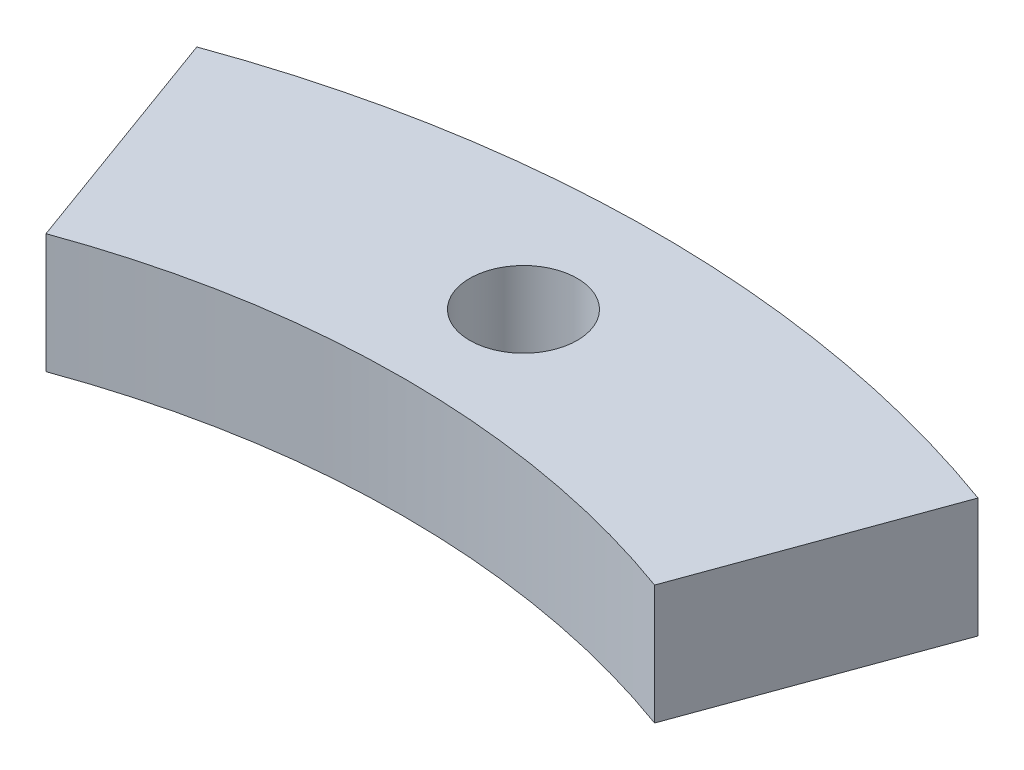
ISO-10303-21;
HEADER;
FILE_DESCRIPTION(('STEP AP214'),'2;1');
FILE_NAME('part.step','',(''),(''),'','','');
FILE_SCHEMA(('AUTOMOTIVE_DESIGN { 1 0 10303 214 1 1 1 1 }'));
ENDSEC;
DATA;
#1=APPLICATION_CONTEXT('core data for automotive mechanical design processes');
#2=APPLICATION_PROTOCOL_DEFINITION('international standard','automotive_design',2000,#1);
#3=PRODUCT_CONTEXT('',#1,'mechanical');
#4=PRODUCT('Part','Part','',(#3));
#5=PRODUCT_RELATED_PRODUCT_CATEGORY('part','',(#4));
#6=PRODUCT_DEFINITION_FORMATION('','',#4);
#7=PRODUCT_DEFINITION_CONTEXT('part definition',#1,'design');
#8=PRODUCT_DEFINITION('design','',#6,#7);
#9=PRODUCT_DEFINITION_SHAPE('','',#8);
#10=(LENGTH_UNIT() NAMED_UNIT(*) SI_UNIT(.MILLI.,.METRE.));
#11=(NAMED_UNIT(*) PLANE_ANGLE_UNIT() SI_UNIT($,.RADIAN.));
#12=(NAMED_UNIT(*) SI_UNIT($,.STERADIAN.) SOLID_ANGLE_UNIT());
#13=UNCERTAINTY_MEASURE_WITH_UNIT(LENGTH_MEASURE(1.E-05),#10,'distance_accuracy_value','');
#14=(GEOMETRIC_REPRESENTATION_CONTEXT(3) GLOBAL_UNCERTAINTY_ASSIGNED_CONTEXT((#13)) GLOBAL_UNIT_ASSIGNED_CONTEXT((#10,
#11,#12)) REPRESENTATION_CONTEXT('',''));
#15=CARTESIAN_POINT('',(0.,0.,0.));
#16=DIRECTION('',(0.,0.,1.));
#17=DIRECTION('',(1.,0.,0.));
#18=AXIS2_PLACEMENT_3D('',#15,#16,#17);
#19=CARTESIAN_POINT('',(0.,4.5,0.));
#20=DIRECTION('',(0.,1.,0.));
#21=DIRECTION('',(0.,0.,1.));
#22=AXIS2_PLACEMENT_3D('',#19,#20,#21);
#23=PLANE('',#22);
#24=CARTESIAN_POINT('',(0.,4.5,-38.));
#25=DIRECTION('',(0.,1.,0.));
#26=DIRECTION('',(0.,0.,1.));
#27=AXIS2_PLACEMENT_3D('',#24,#25,#26);
#28=CIRCLE('',#27,2.025);
#29=CARTESIAN_POINT('',(0.,4.5,-35.975));
#30=VERTEX_POINT('',#29);
#31=EDGE_CURVE('E91',#30,#30,#28,.T.);
#32=ORIENTED_EDGE('',*,*,#31,.F.);
#33=EDGE_LOOP('',(#32));
#34=FACE_BOUND('',#33,.T.);
#35=CARTESIAN_POINT('',(0.,4.5,0.));
#36=DIRECTION('',(0.,1.,0.));
#37=DIRECTION('',(0.,0.,1.));
#38=AXIS2_PLACEMENT_3D('',#35,#36,#37);
#39=CIRCLE('',#38,43.);
#40=CARTESIAN_POINT('',(14.7068661630035,4.5,-40.4067826937942));
#41=VERTEX_POINT('',#40);
#42=CARTESIAN_POINT('',(-14.7068661630035,4.5,-40.4067826937942));
#43=VERTEX_POINT('',#42);
#44=EDGE_CURVE('E95',#41,#43,#39,.T.);
#45=ORIENTED_EDGE('',*,*,#44,.T.);
#46=DIRECTION('',(0.342020143325663,0.,0.939692620785911));
#47=VECTOR('',#46,1.);
#48=CARTESIAN_POINT('',(0.,4.5,0.));
#49=LINE('',#48,#47);
#50=CARTESIAN_POINT('',(-11.4576748014097,4.5,-31.479702796328));
#51=VERTEX_POINT('',#50);
#52=EDGE_CURVE('E76',#43,#51,#49,.T.);
#53=ORIENTED_EDGE('',*,*,#52,.T.);
#54=CARTESIAN_POINT('',(0.,4.5,0.));
#55=DIRECTION('',(0.,1.,0.));
#56=DIRECTION('',(0.,0.,1.));
#57=AXIS2_PLACEMENT_3D('',#54,#55,#56);
#58=CIRCLE('',#57,33.5);
#59=CARTESIAN_POINT('',(11.4576748014097,4.5,-31.479702796328));
#60=VERTEX_POINT('',#59);
#61=EDGE_CURVE('E96',#60,#51,#58,.T.);
#62=ORIENTED_EDGE('',*,*,#61,.F.);
#63=DIRECTION('',(-0.342020143325663,0.,0.939692620785911));
#64=VECTOR('',#63,1.);
#65=CARTESIAN_POINT('',(0.,4.5,0.));
#66=LINE('',#65,#64);
#67=EDGE_CURVE('E57',#41,#60,#66,.T.);
#68=ORIENTED_EDGE('',*,*,#67,.F.);
#69=EDGE_LOOP('',(#45,#53,#62,#68));
#70=FACE_BOUND('',#69,.T.);
#71=ADVANCED_FACE('F35',(#34,#70),#23,.T.);
#72=CARTESIAN_POINT('',(0.,0.,0.));
#73=DIRECTION('',(0.,1.,0.));
#74=DIRECTION('',(0.,0.,1.));
#75=AXIS2_PLACEMENT_3D('',#72,#73,#74);
#76=PLANE('',#75);
#77=CARTESIAN_POINT('',(0.,0.,-38.));
#78=DIRECTION('',(0.,1.,0.));
#79=DIRECTION('',(0.,0.,1.));
#80=AXIS2_PLACEMENT_3D('',#77,#78,#79);
#81=CIRCLE('',#80,2.025);
#82=CARTESIAN_POINT('',(0.,0.,-35.975));
#83=VERTEX_POINT('',#82);
#84=EDGE_CURVE('E113',#83,#83,#81,.T.);
#85=ORIENTED_EDGE('',*,*,#84,.T.);
#86=EDGE_LOOP('',(#85));
#87=FACE_BOUND('',#86,.T.);
#88=DIRECTION('',(0.342020143325663,0.,0.939692620785911));
#89=VECTOR('',#88,1.);
#90=CARTESIAN_POINT('',(0.,0.,0.));
#91=LINE('',#90,#89);
#92=CARTESIAN_POINT('',(-14.7068661630035,0.,-40.4067826937941));
#93=VERTEX_POINT('',#92);
#94=CARTESIAN_POINT('',(-11.4576748014097,0.,-31.479702796328));
#95=VERTEX_POINT('',#94);
#96=EDGE_CURVE('E50',#93,#95,#91,.T.);
#97=ORIENTED_EDGE('',*,*,#96,.F.);
#98=CARTESIAN_POINT('',(0.,0.,0.));
#99=DIRECTION('',(0.,1.,0.));
#100=DIRECTION('',(0.,0.,1.));
#101=AXIS2_PLACEMENT_3D('',#98,#99,#100);
#102=CIRCLE('',#101,43.);
#103=CARTESIAN_POINT('',(14.7068661630035,0.,-40.4067826937941));
#104=VERTEX_POINT('',#103);
#105=EDGE_CURVE('E88',#104,#93,#102,.T.);
#106=ORIENTED_EDGE('',*,*,#105,.F.);
#107=DIRECTION('',(-0.342020143325663,0.,0.939692620785911));
#108=VECTOR('',#107,1.);
#109=CARTESIAN_POINT('',(0.,0.,0.));
#110=LINE('',#109,#108);
#111=CARTESIAN_POINT('',(11.4576748014097,0.,-31.479702796328));
#112=VERTEX_POINT('',#111);
#113=EDGE_CURVE('E81',#104,#112,#110,.T.);
#114=ORIENTED_EDGE('',*,*,#113,.T.);
#115=CARTESIAN_POINT('',(0.,0.,0.));
#116=DIRECTION('',(0.,1.,0.));
#117=DIRECTION('',(0.,0.,1.));
#118=AXIS2_PLACEMENT_3D('',#115,#116,#117);
#119=CIRCLE('',#118,33.5);
#120=EDGE_CURVE('E90',#112,#95,#119,.T.);
#121=ORIENTED_EDGE('',*,*,#120,.T.);
#122=EDGE_LOOP('',(#97,#106,#114,#121));
#123=FACE_BOUND('',#122,.T.);
#124=ADVANCED_FACE('F86',(#87,#123),#76,.F.);
#125=CARTESIAN_POINT('',(0.,4.5,0.));
#126=DIRECTION('',(0.,-1.,0.));
#127=DIRECTION('',(0.,0.,-1.));
#128=AXIS2_PLACEMENT_3D('',#125,#126,#127);
#129=CYLINDRICAL_SURFACE('',#128,43.);
#130=DIRECTION('',(0.,-1.,0.));
#131=VECTOR('',#130,1.);
#132=CARTESIAN_POINT('',(-14.7068661630035,4.5,-40.4067826937942));
#133=LINE('',#132,#131);
#134=EDGE_CURVE('E73',#43,#93,#133,.T.);
#135=ORIENTED_EDGE('',*,*,#134,.F.);
#136=ORIENTED_EDGE('',*,*,#44,.F.);
#137=DIRECTION('',(0.,-1.,0.));
#138=VECTOR('',#137,1.);
#139=CARTESIAN_POINT('',(14.7068661630035,4.5,-40.4067826937942));
#140=LINE('',#139,#138);
#141=EDGE_CURVE('E94',#41,#104,#140,.T.);
#142=ORIENTED_EDGE('',*,*,#141,.T.);
#143=ORIENTED_EDGE('',*,*,#105,.T.);
#144=EDGE_LOOP('',(#135,#136,#142,#143));
#145=FACE_BOUND('',#144,.T.);
#146=ADVANCED_FACE('F37',(#145),#129,.T.);
#147=CARTESIAN_POINT('',(0.,4.5,0.));
#148=DIRECTION('',(0.,-1.,0.));
#149=DIRECTION('',(0.,0.,-1.));
#150=AXIS2_PLACEMENT_3D('',#147,#148,#149);
#151=CYLINDRICAL_SURFACE('',#150,33.5);
#152=ORIENTED_EDGE('',*,*,#61,.T.);
#153=DIRECTION('',(0.,-1.,0.));
#154=VECTOR('',#153,1.);
#155=CARTESIAN_POINT('',(-11.4576748014097,4.5,-31.479702796328));
#156=LINE('',#155,#154);
#157=EDGE_CURVE('E11',#51,#95,#156,.T.);
#158=ORIENTED_EDGE('',*,*,#157,.T.);
#159=ORIENTED_EDGE('',*,*,#120,.F.);
#160=DIRECTION('',(0.,-1.,0.));
#161=VECTOR('',#160,1.);
#162=CARTESIAN_POINT('',(11.4576748014097,4.5,-31.479702796328));
#163=LINE('',#162,#161);
#164=EDGE_CURVE('E43',#60,#112,#163,.T.);
#165=ORIENTED_EDGE('',*,*,#164,.F.);
#166=EDGE_LOOP('',(#152,#158,#159,#165));
#167=FACE_BOUND('',#166,.T.);
#168=ADVANCED_FACE('F106',(#167),#151,.F.);
#169=CARTESIAN_POINT('',(0.,0.,0.));
#170=DIRECTION('',(-0.939692620785911,0.,-0.342020143325663));
#171=DIRECTION('',(-0.342020143325663,0.,0.939692620785911));
#172=AXIS2_PLACEMENT_3D('',#169,#170,#171);
#173=PLANE('',#172);
#174=ORIENTED_EDGE('',*,*,#67,.T.);
#175=ORIENTED_EDGE('',*,*,#164,.T.);
#176=ORIENTED_EDGE('',*,*,#113,.F.);
#177=ORIENTED_EDGE('',*,*,#141,.F.);
#178=EDGE_LOOP('',(#174,#175,#176,#177));
#179=FACE_BOUND('',#178,.T.);
#180=ADVANCED_FACE('F102',(#179),#173,.F.);
#181=CARTESIAN_POINT('',(0.,0.,0.));
#182=DIRECTION('',(-0.939692620785911,0.,0.342020143325663));
#183=DIRECTION('',(0.342020143325663,0.,0.939692620785911));
#184=AXIS2_PLACEMENT_3D('',#181,#182,#183);
#185=PLANE('',#184);
#186=ORIENTED_EDGE('',*,*,#134,.T.);
#187=ORIENTED_EDGE('',*,*,#96,.T.);
#188=ORIENTED_EDGE('',*,*,#157,.F.);
#189=ORIENTED_EDGE('',*,*,#52,.F.);
#190=EDGE_LOOP('',(#186,#187,#188,#189));
#191=FACE_BOUND('',#190,.T.);
#192=ADVANCED_FACE('F74',(#191),#185,.T.);
#193=CARTESIAN_POINT('',(0.,0.,-38.));
#194=DIRECTION('',(0.,1.,0.));
#195=DIRECTION('',(0.,0.,1.));
#196=AXIS2_PLACEMENT_3D('',#193,#194,#195);
#197=CYLINDRICAL_SURFACE('',#196,2.025);
#198=ORIENTED_EDGE('',*,*,#31,.T.);
#199=EDGE_LOOP('',(#198));
#200=FACE_BOUND('',#199,.T.);
#201=ORIENTED_EDGE('',*,*,#84,.F.);
#202=EDGE_LOOP('',(#201));
#203=FACE_BOUND('',#202,.T.);
#204=ADVANCED_FACE('F118',(#200,#203),#197,.F.);
#205=CLOSED_SHELL('',(#71,#124,#146,#168,#180,#192,#204));
#206=MANIFOLD_SOLID_BREP('B2',#205);
#207=ADVANCED_BREP_SHAPE_REPRESENTATION('',(#18,#206),#14);
#208=SHAPE_DEFINITION_REPRESENTATION(#9,#207);
ENDSEC;
END-ISO-10303-21;
